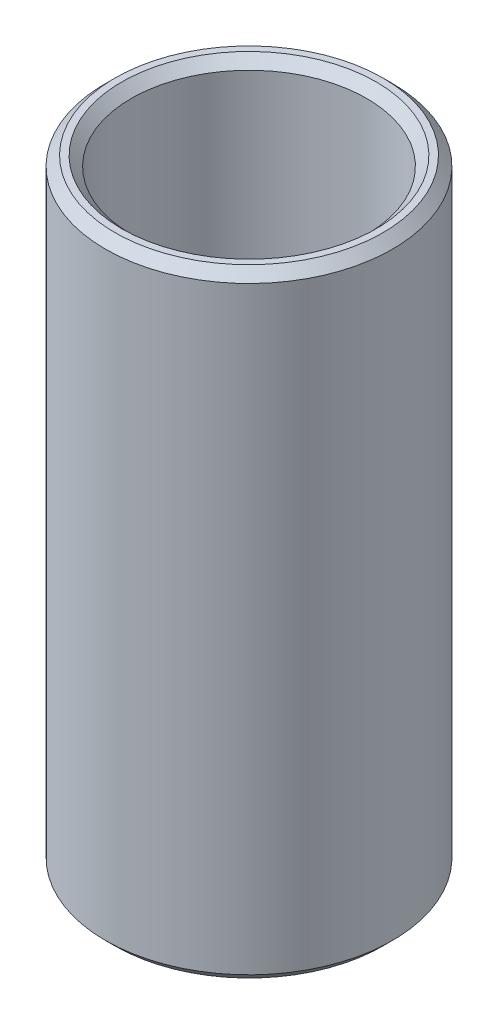
ISO-10303-21;
HEADER;
FILE_DESCRIPTION(('STEP AP214'),'2;1');
FILE_NAME('part.step','',(''),(''),'','','');
FILE_SCHEMA(('AUTOMOTIVE_DESIGN { 1 0 10303 214 1 1 1 1 }'));
ENDSEC;
DATA;
#1=APPLICATION_CONTEXT('core data for automotive mechanical design processes');
#2=APPLICATION_PROTOCOL_DEFINITION('international standard','automotive_design',2000,#1);
#3=PRODUCT_CONTEXT('',#1,'mechanical');
#4=PRODUCT('Part','Part','',(#3));
#5=PRODUCT_RELATED_PRODUCT_CATEGORY('part','',(#4));
#6=PRODUCT_DEFINITION_FORMATION('','',#4);
#7=PRODUCT_DEFINITION_CONTEXT('part definition',#1,'design');
#8=PRODUCT_DEFINITION('design','',#6,#7);
#9=PRODUCT_DEFINITION_SHAPE('','',#8);
#10=(LENGTH_UNIT() NAMED_UNIT(*) SI_UNIT(.MILLI.,.METRE.));
#11=(NAMED_UNIT(*) PLANE_ANGLE_UNIT() SI_UNIT($,.RADIAN.));
#12=(NAMED_UNIT(*) SI_UNIT($,.STERADIAN.) SOLID_ANGLE_UNIT());
#13=UNCERTAINTY_MEASURE_WITH_UNIT(LENGTH_MEASURE(1.E-05),#10,'distance_accuracy_value','');
#14=(GEOMETRIC_REPRESENTATION_CONTEXT(3) GLOBAL_UNCERTAINTY_ASSIGNED_CONTEXT((#13)) GLOBAL_UNIT_ASSIGNED_CONTEXT((#10,
#11,#12)) REPRESENTATION_CONTEXT('',''));
#15=CARTESIAN_POINT('',(0.,0.,0.));
#16=DIRECTION('',(0.,0.,1.));
#17=DIRECTION('',(1.,0.,0.));
#18=AXIS2_PLACEMENT_3D('',#15,#16,#17);
#19=CARTESIAN_POINT('',(0.,96.8519992224908,0.));
#20=DIRECTION('',(0.,-1.,0.));
#21=DIRECTION('',(0.,0.,-1.));
#22=AXIS2_PLACEMENT_3D('',#19,#20,#21);
#23=CYLINDRICAL_SURFACE('',#22,22.5);
#24=CARTESIAN_POINT('',(0.,1.49377692011543,0.));
#25=DIRECTION('',(0.,1.,0.));
#26=DIRECTION('',(0.,0.,1.));
#27=AXIS2_PLACEMENT_3D('',#24,#25,#26);
#28=CIRCLE('',#27,22.5);
#29=CARTESIAN_POINT('',(0.,1.49377692011543,-22.5));
#30=VERTEX_POINT('',#29);
#31=EDGE_CURVE('E10',#30,#30,#28,.T.);
#32=CARTESIAN_POINT('',(0.,95.3582223023754,0.));
#33=DIRECTION('',(0.,1.,0.));
#34=DIRECTION('',(0.,0.,1.));
#35=AXIS2_PLACEMENT_3D('',#32,#33,#34);
#36=CIRCLE('',#35,22.5);
#37=CARTESIAN_POINT('',(0.,95.3582223023754,-22.5));
#38=VERTEX_POINT('',#37);
#39=EDGE_CURVE('E50',#38,#38,#36,.F.);
#40=CARTESIAN_POINT('',(0.,1.49377692011543,-22.5));
#41=CARTESIAN_POINT('',(0.,2.47153155951397,-22.5));
#42=CARTESIAN_POINT('',(0.,3.44928619891251,-22.5));
#43=CARTESIAN_POINT('',(0.,5.40479547770959,-22.5));
#44=CARTESIAN_POINT('',(0.,6.38255011710813,-22.5));
#45=CARTESIAN_POINT('',(0.,8.33805939590522,-22.5));
#46=CARTESIAN_POINT('',(0.,9.31581403530376,-22.5));
#47=CARTESIAN_POINT('',(0.,11.2713233141008,-22.5));
#48=CARTESIAN_POINT('',(0.,12.2490779534994,-22.5));
#49=CARTESIAN_POINT('',(0.,14.2045872322965,-22.5));
#50=CARTESIAN_POINT('',(0.,15.182341871695,-22.5));
#51=CARTESIAN_POINT('',(0.,17.1378511504921,-22.5));
#52=CARTESIAN_POINT('',(0.,18.1156057898906,-22.5));
#53=CARTESIAN_POINT('',(0.,20.0711150686877,-22.5));
#54=CARTESIAN_POINT('',(0.,21.0488697080863,-22.5));
#55=CARTESIAN_POINT('',(0.,23.0043789868833,-22.5));
#56=CARTESIAN_POINT('',(0.,23.9821336262819,-22.5));
#57=CARTESIAN_POINT('',(0.,25.937642905079,-22.5));
#58=CARTESIAN_POINT('',(0.,26.9153975444775,-22.5));
#59=CARTESIAN_POINT('',(0.,28.8709068232746,-22.5));
#60=CARTESIAN_POINT('',(0.,29.8486614626731,-22.5));
#61=CARTESIAN_POINT('',(0.,31.8041707414702,-22.5));
#62=CARTESIAN_POINT('',(0.,32.7819253808688,-22.5));
#63=CARTESIAN_POINT('',(0.,34.7374346596658,-22.5));
#64=CARTESIAN_POINT('',(0.,35.7151892990644,-22.5));
#65=CARTESIAN_POINT('',(0.,37.6706985778615,-22.5));
#66=CARTESIAN_POINT('',(0.,38.64845321726,-22.5));
#67=CARTESIAN_POINT('',(0.,40.6039624960571,-22.5));
#68=CARTESIAN_POINT('',(0.,41.5817171354556,-22.5));
#69=CARTESIAN_POINT('',(0.,43.5372264142527,-22.5));
#70=CARTESIAN_POINT('',(0.,44.5149810536513,-22.5));
#71=CARTESIAN_POINT('',(0.,46.4704903324483,-22.5));
#72=CARTESIAN_POINT('',(0.,47.4482449718469,-22.5));
#73=CARTESIAN_POINT('',(0.,49.4037542506439,-22.5));
#74=CARTESIAN_POINT('',(0.,50.3815088900425,-22.5));
#75=CARTESIAN_POINT('',(0.,52.3370181688396,-22.5));
#76=CARTESIAN_POINT('',(0.,53.3147728082381,-22.5));
#77=CARTESIAN_POINT('',(0.,55.2702820870352,-22.5));
#78=CARTESIAN_POINT('',(0.,56.2480367264337,-22.5));
#79=CARTESIAN_POINT('',(0.,58.2035460052308,-22.5));
#80=CARTESIAN_POINT('',(0.,59.1813006446294,-22.5));
#81=CARTESIAN_POINT('',(0.,61.1368099234264,-22.5));
#82=CARTESIAN_POINT('',(0.,62.114564562825,-22.5));
#83=CARTESIAN_POINT('',(0.,64.0700738416221,-22.5));
#84=CARTESIAN_POINT('',(0.,65.0478284810206,-22.5));
#85=CARTESIAN_POINT('',(0.,67.0033377598177,-22.5));
#86=CARTESIAN_POINT('',(0.,67.9810923992162,-22.5));
#87=CARTESIAN_POINT('',(0.,69.9366016780133,-22.5));
#88=CARTESIAN_POINT('',(0.,70.9143563174119,-22.5));
#89=CARTESIAN_POINT('',(0.,72.869865596209,-22.5));
#90=CARTESIAN_POINT('',(0.,73.8476202356075,-22.5));
#91=CARTESIAN_POINT('',(0.,75.8031295144046,-22.5));
#92=CARTESIAN_POINT('',(0.,76.7808841538031,-22.5));
#93=CARTESIAN_POINT('',(0.,78.7363934326002,-22.5));
#94=CARTESIAN_POINT('',(0.,79.7141480719987,-22.5));
#95=CARTESIAN_POINT('',(0.,81.6696573507958,-22.5));
#96=CARTESIAN_POINT('',(0.,82.6474119901944,-22.5));
#97=CARTESIAN_POINT('',(0.,84.6029212689915,-22.5));
#98=CARTESIAN_POINT('',(0.,85.58067590839,-22.5));
#99=CARTESIAN_POINT('',(0.,87.5361851871871,-22.5));
#100=CARTESIAN_POINT('',(0.,88.5139398265856,-22.5));
#101=CARTESIAN_POINT('',(0.,90.4694491053827,-22.5));
#102=CARTESIAN_POINT('',(0.,91.4472037447812,-22.5));
#103=CARTESIAN_POINT('',(0.,93.4027130235783,-22.5));
#104=CARTESIAN_POINT('',(0.,94.3804676629769,-22.5));
#105=CARTESIAN_POINT('',(0.,95.3582223023754,-22.5));
#106=B_SPLINE_CURVE_WITH_KNOTS('',3,(#40,#41,#42,#43,#44,#45,#46,#47,#48,#49,#50,#51,#52,#53,
#54,#55,#56,#57,#58,#59,#60,#61,#62,#63,#64,#65,#66,#67,#68,#69,#70,#71,#72,#73,#74,#75,#76,#77,
#78,#79,#80,#81,#82,#83,#84,#85,#86,#87,#88,#89,#90,#91,#92,#93,#94,#95,#96,#97,#98,#99,#100,
#101,#102,#103,#104,#105),.UNSPECIFIED.,.F.,.F.,(4,2,2,2,2,2,2,2,2,2,2,2,2,2,2,2,2,2,2,2,2,2,2,
2,2,2,2,2,2,2,2,2,4),(0.,2.93326391819562,5.86652783639124,8.79979175458687,11.7330556727825,
14.6663195909781,17.5995835091737,20.5328474273694,23.466111345565,26.3993752637606,
29.3326391819562,32.2659031001519,35.1991670183475,38.1324309365431,41.0656948547387,
43.9989587729344,46.93222269113,49.8654866093256,52.7987505275212,55.7320144457169,
58.6652783639125,61.5985422821081,64.5318062003037,67.4650701184994,70.398334036695,
73.3315979548906,76.2648618730862,79.1981257912818,82.1313897094775,85.0646536276731,
87.9979175458687,90.9311814640643,93.86444538226),.UNSPECIFIED.);
#107=EDGE_CURVE('BSEAM39',#30,#38,#106,.T.);
#108=ORIENTED_EDGE('',*,*,#31,.T.);
#109=ORIENTED_EDGE('',*,*,#39,.T.);
#110=ORIENTED_EDGE('',*,*,#107,.T.);
#111=ORIENTED_EDGE('',*,*,#107,.F.);
#112=EDGE_LOOP('',(#108,#110,#109,#111));
#113=FACE_BOUND('',#112,.T.);
#114=ADVANCED_FACE('F39',(#113),#23,.T.);
#115=CARTESIAN_POINT('',(0.,96.8519992224908,0.));
#116=DIRECTION('',(0.,1.,0.));
#117=DIRECTION('',(0.,0.,1.));
#118=AXIS2_PLACEMENT_3D('',#115,#116,#117);
#119=PLANE('',#118);
#120=CARTESIAN_POINT('',(0.,96.8519992224908,0.));
#121=DIRECTION('',(0.,1.,0.));
#122=DIRECTION('',(0.,0.,1.));
#123=AXIS2_PLACEMENT_3D('',#120,#121,#122);
#124=CIRCLE('',#123,19.9461633434245);
#125=CARTESIAN_POINT('',(0.,96.8519992224908,19.9461633434245));
#126=VERTEX_POINT('',#125);
#127=EDGE_CURVE('E58',#126,#126,#124,.F.);
#128=ORIENTED_EDGE('',*,*,#127,.T.);
#129=EDGE_LOOP('',(#128));
#130=FACE_BOUND('',#129,.T.);
#131=CARTESIAN_POINT('',(0.,96.8519992224908,0.));
#132=DIRECTION('',(0.,1.,0.));
#133=DIRECTION('',(0.,0.,1.));
#134=AXIS2_PLACEMENT_3D('',#131,#132,#133);
#135=CIRCLE('',#134,21.0062230798846);
#136=CARTESIAN_POINT('',(0.,96.8519992224908,-21.0062230798846));
#137=VERTEX_POINT('',#136);
#138=EDGE_CURVE('E61',#137,#137,#135,.T.);
#139=ORIENTED_EDGE('',*,*,#138,.T.);
#140=EDGE_LOOP('',(#139));
#141=FACE_BOUND('',#140,.T.);
#142=ADVANCED_FACE('F88',(#130,#141),#119,.T.);
#143=CARTESIAN_POINT('',(0.,0.,0.));
#144=DIRECTION('',(0.,1.,0.));
#145=DIRECTION('',(0.,0.,1.));
#146=AXIS2_PLACEMENT_3D('',#143,#144,#145);
#147=PLANE('',#146);
#148=CARTESIAN_POINT('',(0.,0.,0.));
#149=DIRECTION('',(0.,1.,0.));
#150=DIRECTION('',(0.,0.,1.));
#151=AXIS2_PLACEMENT_3D('',#148,#149,#150);
#152=CIRCLE('',#151,19.9461633434245);
#153=CARTESIAN_POINT('',(0.,0.,19.9461633434245));
#154=VERTEX_POINT('',#153);
#155=EDGE_CURVE('E51',#154,#154,#152,.T.);
#156=ORIENTED_EDGE('',*,*,#155,.T.);
#157=EDGE_LOOP('',(#156));
#158=FACE_BOUND('',#157,.T.);
#159=CARTESIAN_POINT('',(0.,0.,0.));
#160=DIRECTION('',(0.,1.,0.));
#161=DIRECTION('',(0.,0.,1.));
#162=AXIS2_PLACEMENT_3D('',#159,#160,#161);
#163=CIRCLE('',#162,21.0062230798845);
#164=CARTESIAN_POINT('',(0.,0.,21.0062230798845));
#165=VERTEX_POINT('',#164);
#166=EDGE_CURVE('E54',#165,#165,#163,.F.);
#167=ORIENTED_EDGE('',*,*,#166,.T.);
#168=EDGE_LOOP('',(#167));
#169=FACE_BOUND('',#168,.T.);
#170=ADVANCED_FACE('F83',(#158,#169),#147,.F.);
#171=CARTESIAN_POINT('',(0.,96.8519992224908,0.));
#172=DIRECTION('',(0.,-1.,0.));
#173=DIRECTION('',(0.,0.,-1.));
#174=AXIS2_PLACEMENT_3D('',#171,#172,#173);
#175=CYLINDRICAL_SURFACE('',#174,18.4523864233091);
#176=CARTESIAN_POINT('',(0.,95.3582223023754,0.));
#177=DIRECTION('',(0.,1.,0.));
#178=DIRECTION('',(0.,0.,1.));
#179=AXIS2_PLACEMENT_3D('',#176,#177,#178);
#180=CIRCLE('',#179,18.4523864233091);
#181=CARTESIAN_POINT('',(0.,95.3582223023754,18.4523864233091));
#182=VERTEX_POINT('',#181);
#183=EDGE_CURVE('E67',#182,#182,#180,.T.);
#184=ORIENTED_EDGE('',*,*,#183,.T.);
#185=EDGE_LOOP('',(#184));
#186=FACE_BOUND('',#185,.T.);
#187=CARTESIAN_POINT('',(0.,1.49377692011544,0.));
#188=DIRECTION('',(0.,1.,0.));
#189=DIRECTION('',(0.,0.,1.));
#190=AXIS2_PLACEMENT_3D('',#187,#188,#189);
#191=CIRCLE('',#190,18.4523864233091);
#192=CARTESIAN_POINT('',(0.,1.49377692011544,18.4523864233091));
#193=VERTEX_POINT('',#192);
#194=EDGE_CURVE('E69',#193,#193,#191,.F.);
#195=ORIENTED_EDGE('',*,*,#194,.T.);
#196=EDGE_LOOP('',(#195));
#197=FACE_BOUND('',#196,.T.);
#198=ADVANCED_FACE('F71',(#186,#197),#175,.F.);
#199=CARTESIAN_POINT('',(0.,95.3582223023754,0.));
#200=DIRECTION('',(0.,1.,0.));
#201=DIRECTION('',(0.,0.,1.));
#202=AXIS2_PLACEMENT_3D('',#199,#200,#201);
#203=CONICAL_SURFACE('',#202,18.4523864233091,0.785398163397449);
#204=ORIENTED_EDGE('',*,*,#127,.F.);
#205=EDGE_LOOP('',(#204));
#206=FACE_BOUND('',#205,.T.);
#207=ORIENTED_EDGE('',*,*,#183,.F.);
#208=EDGE_LOOP('',(#207));
#209=FACE_BOUND('',#208,.T.);
#210=ADVANCED_FACE('F77',(#206,#209),#203,.F.);
#211=CARTESIAN_POINT('',(0.,0.,0.));
#212=DIRECTION('',(0.,-1.,0.));
#213=DIRECTION('',(0.,0.,-1.));
#214=AXIS2_PLACEMENT_3D('',#211,#212,#213);
#215=CONICAL_SURFACE('',#214,19.9461633434245,0.78539816339744);
#216=ORIENTED_EDGE('',*,*,#194,.F.);
#217=EDGE_LOOP('',(#216));
#218=FACE_BOUND('',#217,.T.);
#219=ORIENTED_EDGE('',*,*,#155,.F.);
#220=EDGE_LOOP('',(#219));
#221=FACE_BOUND('',#220,.T.);
#222=ADVANCED_FACE('F73',(#218,#221),#215,.F.);
#223=CARTESIAN_POINT('',(0.,1.49377692011543,0.));
#224=DIRECTION('',(0.,1.,0.));
#225=DIRECTION('',(0.,0.,1.));
#226=AXIS2_PLACEMENT_3D('',#223,#224,#225);
#227=CONICAL_SURFACE('',#226,22.5,0.785398163397458);
#228=ORIENTED_EDGE('',*,*,#166,.F.);
#229=EDGE_LOOP('',(#228));
#230=FACE_BOUND('',#229,.T.);
#231=ORIENTED_EDGE('',*,*,#31,.F.);
#232=EDGE_LOOP('',(#231));
#233=FACE_BOUND('',#232,.T.);
#234=ADVANCED_FACE('F76',(#230,#233),#227,.T.);
#235=CARTESIAN_POINT('',(0.,96.8519992224908,0.));
#236=DIRECTION('',(0.,-1.,0.));
#237=DIRECTION('',(0.,0.,-1.));
#238=AXIS2_PLACEMENT_3D('',#235,#236,#237);
#239=CONICAL_SURFACE('',#238,21.0062230798846,0.785398163397447);
#240=CARTESIAN_POINT('',(0.,95.3582223023754,-22.5));
#241=CARTESIAN_POINT('',(0.,95.3737824786266,-22.4844398237488));
#242=CARTESIAN_POINT('',(0.,95.3893426548778,-22.4688796474976));
#243=CARTESIAN_POINT('',(0.,95.4204630073802,-22.4377592949952));
#244=CARTESIAN_POINT('',(0.,95.4360231836314,-22.422199118744));
#245=CARTESIAN_POINT('',(0.,95.4671435361338,-22.3910787662416));
#246=CARTESIAN_POINT('',(0.,95.482703712385,-22.3755185899904));
#247=CARTESIAN_POINT('',(0.,95.5138240648874,-22.344398237488));
#248=CARTESIAN_POINT('',(0.,95.5293842411386,-22.3288380612368));
#249=CARTESIAN_POINT('',(0.,95.560504593641,-22.2977177087344));
#250=CARTESIAN_POINT('',(0.,95.5760647698922,-22.2821575324832));
#251=CARTESIAN_POINT('',(0.,95.6071851223946,-22.2510371799808));
#252=CARTESIAN_POINT('',(0.,95.6227452986458,-22.2354770037296));
#253=CARTESIAN_POINT('',(0.,95.6538656511482,-22.2043566512272));
#254=CARTESIAN_POINT('',(0.,95.6694258273994,-22.188796474976));
#255=CARTESIAN_POINT('',(0.,95.7005461799018,-22.1576761224736));
#256=CARTESIAN_POINT('',(0.,95.716106356153,-22.1421159462224));
#257=CARTESIAN_POINT('',(0.,95.7472267086554,-22.1109955937199));
#258=CARTESIAN_POINT('',(0.,95.7627868849066,-22.0954354174687));
#259=CARTESIAN_POINT('',(0.,95.7939072374091,-22.0643150649663));
#260=CARTESIAN_POINT('',(0.,95.8094674136603,-22.0487548887151));
#261=CARTESIAN_POINT('',(0.,95.8405877661627,-22.0176345362127));
#262=CARTESIAN_POINT('',(0.,95.8561479424139,-22.0020743599615));
#263=CARTESIAN_POINT('',(0.,95.8872682949163,-21.9709540074591));
#264=CARTESIAN_POINT('',(0.,95.9028284711675,-21.9553938312079));
#265=CARTESIAN_POINT('',(0.,95.9339488236699,-21.9242734787055));
#266=CARTESIAN_POINT('',(0.,95.9495089999211,-21.9087133024543));
#267=CARTESIAN_POINT('',(0.,95.9806293524235,-21.8775929499519));
#268=CARTESIAN_POINT('',(0.,95.9961895286747,-21.8620327737007));
#269=CARTESIAN_POINT('',(0.,96.0273098811771,-21.8309124211983));
#270=CARTESIAN_POINT('',(0.,96.0428700574283,-21.8153522449471));
#271=CARTESIAN_POINT('',(0.,96.0739904099307,-21.7842318924447));
#272=CARTESIAN_POINT('',(0.,96.0895505861819,-21.7686717161935));
#273=CARTESIAN_POINT('',(0.,96.1206709386843,-21.7375513636911));
#274=CARTESIAN_POINT('',(0.,96.1362311149355,-21.7219911874399));
#275=CARTESIAN_POINT('',(0.,96.1673514674379,-21.6908708349375));
#276=CARTESIAN_POINT('',(0.,96.1829116436891,-21.6753106586863));
#277=CARTESIAN_POINT('',(0.,96.2140319961915,-21.6441903061839));
#278=CARTESIAN_POINT('',(0.,96.2295921724427,-21.6286301299327));
#279=CARTESIAN_POINT('',(0.,96.2607125249451,-21.5975097774303));
#280=CARTESIAN_POINT('',(0.,96.2762727011963,-21.5819496011791));
#281=CARTESIAN_POINT('',(0.,96.3073930536987,-21.5508292486767));
#282=CARTESIAN_POINT('',(0.,96.3229532299499,-21.5352690724255));
#283=CARTESIAN_POINT('',(0.,96.3540735824523,-21.5041487199231));
#284=CARTESIAN_POINT('',(0.,96.3696337587035,-21.4885885436719));
#285=CARTESIAN_POINT('',(0.,96.400754111206,-21.4574681911695));
#286=CARTESIAN_POINT('',(0.,96.4163142874571,-21.4419080149183));
#287=CARTESIAN_POINT('',(0.,96.4474346399596,-21.4107876624158));
#288=CARTESIAN_POINT('',(0.,96.4629948162108,-21.3952274861646));
#289=CARTESIAN_POINT('',(0.,96.4941151687132,-21.3641071336622));
#290=CARTESIAN_POINT('',(0.,96.5096753449644,-21.348546957411));
#291=CARTESIAN_POINT('',(0.,96.5407956974668,-21.3174266049086));
#292=CARTESIAN_POINT('',(0.,96.556355873718,-21.3018664286574));
#293=CARTESIAN_POINT('',(0.,96.5874762262204,-21.270746076155));
#294=CARTESIAN_POINT('',(0.,96.6030364024716,-21.2551858999038));
#295=CARTESIAN_POINT('',(0.,96.634156754974,-21.2240655474014));
#296=CARTESIAN_POINT('',(0.,96.6497169312252,-21.2085053711502));
#297=CARTESIAN_POINT('',(0.,96.6808372837276,-21.1773850186478));
#298=CARTESIAN_POINT('',(0.,96.6963974599788,-21.1618248423966));
#299=CARTESIAN_POINT('',(0.,96.7275178124812,-21.1307044898942));
#300=CARTESIAN_POINT('',(0.,96.7430779887324,-21.115144313643));
#301=CARTESIAN_POINT('',(0.,96.7741983412348,-21.0840239611406));
#302=CARTESIAN_POINT('',(0.,96.789758517486,-21.0684637848894));
#303=CARTESIAN_POINT('',(0.,96.8208788699884,-21.037343432387));
#304=CARTESIAN_POINT('',(0.,96.8364390462396,-21.0217832561358));
#305=CARTESIAN_POINT('',(0.,96.8519992224908,-21.0062230798846));
#306=B_SPLINE_CURVE_WITH_KNOTS('',3,(#240,#241,#242,#243,#244,#245,#246,#247,#248,#249,#250,
#251,#252,#253,#254,#255,#256,#257,#258,#259,#260,#261,#262,#263,#264,#265,#266,#267,#268,#269,
#270,#271,#272,#273,#274,#275,#276,#277,#278,#279,#280,#281,#282,#283,#284,#285,#286,#287,#288,
#289,#290,#291,#292,#293,#294,#295,#296,#297,#298,#299,#300,#301,#302,#303,#304,#305),
.UNSPECIFIED.,.F.,.F.,(4,2,2,2,2,2,2,2,2,2,2,2,2,2,2,2,2,2,2,2,2,2,2,2,2,2,2,2,2,2,2,2,4),(0.,
0.0660162368621059,0.132032473724202,0.198048710586298,0.264064947448394,0.3300811843105,
0.396097421172596,0.462113658034692,0.528129894896788,0.594146131758894,0.66016236862099,
0.726178605483086,0.792194842345182,0.858211079207288,0.924227316069382,0.990243552931478,
1.05625978979357,1.12227602665568,1.18829226351778,1.25430850037987,1.32032473724197,
1.38634097410407,1.45235721096617,1.51837344782827,1.58438968469037,1.65040592155247,
1.71642215841456,1.78243839527666,1.84845463213877,1.91447086900086,1.98048710586296,
2.04650334272505,2.11251957958716),.UNSPECIFIED.);
#307=EDGE_CURVE('BSEAM45',#38,#137,#306,.T.);
#308=ORIENTED_EDGE('',*,*,#39,.F.);
#309=ORIENTED_EDGE('',*,*,#138,.F.);
#310=ORIENTED_EDGE('',*,*,#307,.T.);
#311=ORIENTED_EDGE('',*,*,#307,.F.);
#312=EDGE_LOOP('',(#308,#310,#309,#311));
#313=FACE_BOUND('',#312,.T.);
#314=ADVANCED_FACE('F45',(#313),#239,.T.);
#315=CLOSED_SHELL('',(#114,#142,#170,#198,#210,#222,#234,#314));
#316=MANIFOLD_SOLID_BREP('B2',#315);
#317=ADVANCED_BREP_SHAPE_REPRESENTATION('',(#18,#316),#14);
#318=SHAPE_DEFINITION_REPRESENTATION(#9,#317);
ENDSEC;
END-ISO-10303-21;
